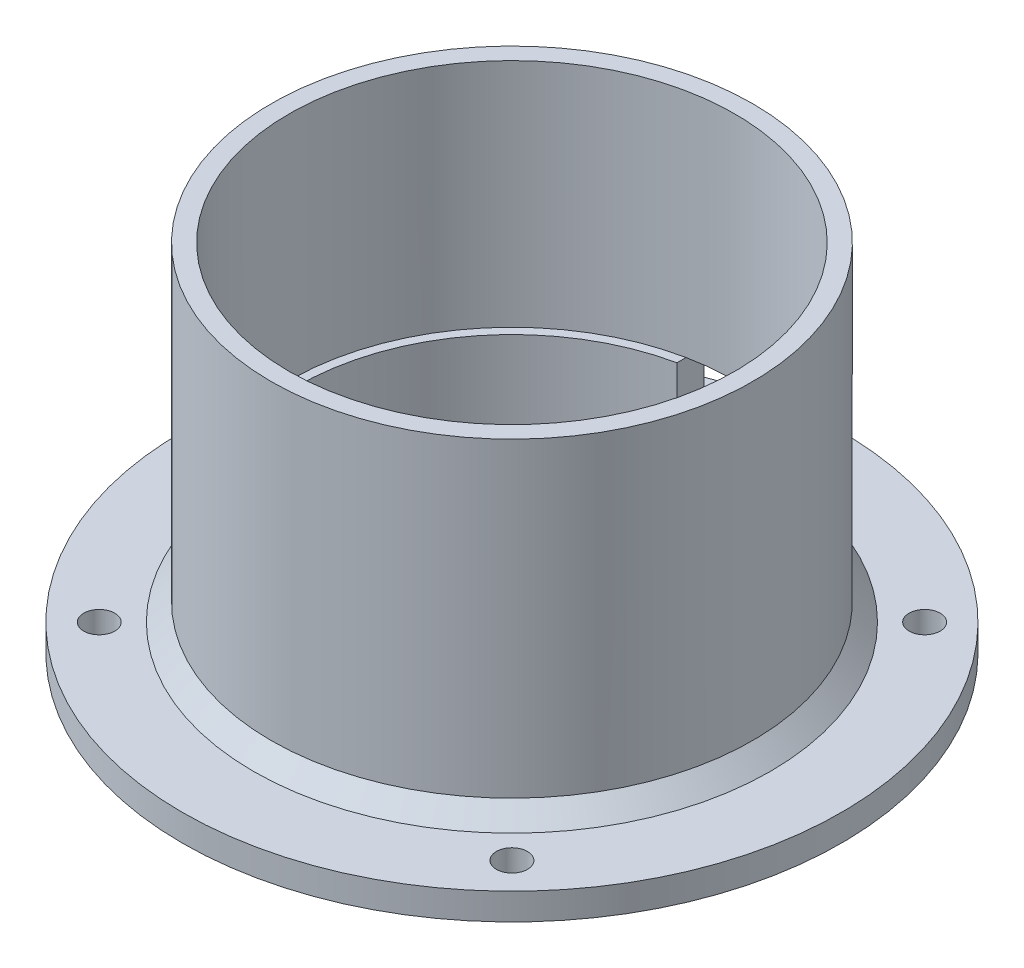
ISO-10303-21;
HEADER;
FILE_DESCRIPTION(('STEP AP214'),'2;1');
FILE_NAME('part.step','',(''),(''),'','','');
FILE_SCHEMA(('AUTOMOTIVE_DESIGN { 1 0 10303 214 1 1 1 1 }'));
ENDSEC;
DATA;
#1=APPLICATION_CONTEXT('core data for automotive mechanical design processes');
#2=APPLICATION_PROTOCOL_DEFINITION('international standard','automotive_design',2000,#1);
#3=PRODUCT_CONTEXT('',#1,'mechanical');
#4=PRODUCT('Part','Part','',(#3));
#5=PRODUCT_RELATED_PRODUCT_CATEGORY('part','',(#4));
#6=PRODUCT_DEFINITION_FORMATION('','',#4);
#7=PRODUCT_DEFINITION_CONTEXT('part definition',#1,'design');
#8=PRODUCT_DEFINITION('design','',#6,#7);
#9=PRODUCT_DEFINITION_SHAPE('','',#8);
#10=(LENGTH_UNIT() NAMED_UNIT(*) SI_UNIT(.MILLI.,.METRE.));
#11=(NAMED_UNIT(*) PLANE_ANGLE_UNIT() SI_UNIT($,.RADIAN.));
#12=(NAMED_UNIT(*) SI_UNIT($,.STERADIAN.) SOLID_ANGLE_UNIT());
#13=UNCERTAINTY_MEASURE_WITH_UNIT(LENGTH_MEASURE(1.E-05),#10,'distance_accuracy_value','');
#14=(GEOMETRIC_REPRESENTATION_CONTEXT(3) GLOBAL_UNCERTAINTY_ASSIGNED_CONTEXT((#13)) GLOBAL_UNIT_ASSIGNED_CONTEXT((#10,
#11,#12)) REPRESENTATION_CONTEXT('',''));
#15=CARTESIAN_POINT('',(0.,0.,0.));
#16=DIRECTION('',(0.,0.,1.));
#17=DIRECTION('',(1.,0.,0.));
#18=AXIS2_PLACEMENT_3D('',#15,#16,#17);
#19=CARTESIAN_POINT('',(0.,0.,0.));
#20=DIRECTION('',(0.,1.,0.));
#21=DIRECTION('',(0.,0.,1.));
#22=AXIS2_PLACEMENT_3D('',#19,#20,#21);
#23=CYLINDRICAL_SURFACE('',#22,25.1);
#24=CARTESIAN_POINT('',(0.,-13.,0.));
#25=DIRECTION('',(0.,1.,0.));
#26=DIRECTION('',(0.,0.,1.));
#27=AXIS2_PLACEMENT_3D('',#24,#25,#26);
#28=CIRCLE('',#27,25.1);
#29=CARTESIAN_POINT('',(5.,-13.,-24.5969510305647));
#30=VERTEX_POINT('',#29);
#31=CARTESIAN_POINT('',(-5.,-13.,-24.5969510305647));
#32=VERTEX_POINT('',#31);
#33=EDGE_CURVE('E162',#30,#32,#28,.T.);
#34=ORIENTED_EDGE('',*,*,#33,.F.);
#35=EDGE_CURVE('E165',#32,#30,#28,.T.);
#36=ORIENTED_EDGE('',*,*,#35,.F.);
#37=EDGE_LOOP('',(#34,#36));
#38=FACE_BOUND('',#37,.T.);
#39=CARTESIAN_POINT('',(0.,13.,0.));
#40=DIRECTION('',(0.,1.,0.));
#41=DIRECTION('',(0.,0.,1.));
#42=AXIS2_PLACEMENT_3D('',#39,#40,#41);
#43=CIRCLE('',#42,25.1);
#44=CARTESIAN_POINT('',(0.,13.,25.1));
#45=VERTEX_POINT('',#44);
#46=EDGE_CURVE('E184',#45,#45,#43,.T.);
#47=ORIENTED_EDGE('',*,*,#46,.T.);
#48=EDGE_LOOP('',(#47));
#49=FACE_BOUND('',#48,.T.);
#50=ADVANCED_FACE('F42',(#38,#49),#23,.F.);
#51=CARTESIAN_POINT('',(25.1,13.,0.));
#52=DIRECTION('',(0.,-1.,0.));
#53=DIRECTION('',(0.,0.,-1.));
#54=AXIS2_PLACEMENT_3D('',#51,#52,#53);
#55=PLANE('',#54);
#56=ORIENTED_EDGE('',*,*,#46,.F.);
#57=EDGE_LOOP('',(#56));
#58=FACE_BOUND('',#57,.T.);
#59=CARTESIAN_POINT('',(0.,13.,0.));
#60=DIRECTION('',(0.,1.,0.));
#61=DIRECTION('',(0.,0.,1.));
#62=AXIS2_PLACEMENT_3D('',#59,#60,#61);
#63=CIRCLE('',#62,27.1);
#64=CARTESIAN_POINT('',(0.,13.,27.1));
#65=VERTEX_POINT('',#64);
#66=EDGE_CURVE('E180',#65,#65,#63,.T.);
#67=ORIENTED_EDGE('',*,*,#66,.T.);
#68=EDGE_LOOP('',(#67));
#69=FACE_BOUND('',#68,.T.);
#70=ADVANCED_FACE('F270',(#58,#69),#55,.F.);
#71=CARTESIAN_POINT('',(0.,0.,0.));
#72=DIRECTION('',(0.,1.,0.));
#73=DIRECTION('',(0.,0.,1.));
#74=AXIS2_PLACEMENT_3D('',#71,#72,#73);
#75=CYLINDRICAL_SURFACE('',#74,27.1);
#76=DIRECTION('',(0.,1.,0.));
#77=VECTOR('',#76,1.);
#78=CARTESIAN_POINT('',(-4.99999999999997,0.,-26.63475173528));
#79=LINE('',#78,#77);
#80=CARTESIAN_POINT('',(-5.,-13.,-26.63475173528));
#81=VERTEX_POINT('',#80);
#82=CARTESIAN_POINT('',(-4.99999999999997,-22.,-26.63475173528));
#83=VERTEX_POINT('',#82);
#84=EDGE_CURVE('E137',#81,#83,#79,.F.);
#85=ORIENTED_EDGE('',*,*,#84,.T.);
#86=CARTESIAN_POINT('',(0.,-22.,0.));
#87=DIRECTION('',(0.,-1.,0.));
#88=DIRECTION('',(0.,0.,-1.));
#89=AXIS2_PLACEMENT_3D('',#86,#87,#88);
#90=CIRCLE('',#89,27.1);
#91=CARTESIAN_POINT('',(5.,-22.,-26.63475173528));
#92=VERTEX_POINT('',#91);
#93=EDGE_CURVE('E106',#83,#92,#90,.F.);
#94=ORIENTED_EDGE('',*,*,#93,.T.);
#95=DIRECTION('',(0.,1.,0.));
#96=VECTOR('',#95,1.);
#97=CARTESIAN_POINT('',(5.,0.,-26.63475173528));
#98=LINE('',#97,#96);
#99=CARTESIAN_POINT('',(5.,-13.,-26.63475173528));
#100=VERTEX_POINT('',#99);
#101=EDGE_CURVE('E124',#92,#100,#98,.T.);
#102=ORIENTED_EDGE('',*,*,#101,.T.);
#103=CARTESIAN_POINT('',(0.,-13.,0.));
#104=DIRECTION('',(0.,1.,0.));
#105=DIRECTION('',(-1.,0.,0.));
#106=AXIS2_PLACEMENT_3D('',#103,#104,#105);
#107=CIRCLE('',#106,27.1);
#108=EDGE_CURVE('E141',#100,#81,#107,.T.);
#109=ORIENTED_EDGE('',*,*,#108,.T.);
#110=EDGE_LOOP('',(#85,#94,#102,#109));
#111=FACE_BOUND('',#110,.T.);
#112=ORIENTED_EDGE('',*,*,#66,.F.);
#113=EDGE_LOOP('',(#112));
#114=FACE_BOUND('',#113,.T.);
#115=ADVANCED_FACE('F266',(#111,#114),#75,.T.);
#116=CARTESIAN_POINT('',(27.1,-24.,0.));
#117=DIRECTION('',(0.,-1.,0.));
#118=DIRECTION('',(0.,0.,-1.));
#119=AXIS2_PLACEMENT_3D('',#116,#117,#118);
#120=PLANE('',#119);
#121=CARTESIAN_POINT('',(0.,-24.,0.));
#122=DIRECTION('',(0.,-1.,0.));
#123=DIRECTION('',(0.,0.,-1.));
#124=AXIS2_PLACEMENT_3D('',#121,#122,#123);
#125=CIRCLE('',#124,29.1);
#126=CARTESIAN_POINT('',(0.,-24.,-29.1));
#127=VERTEX_POINT('',#126);
#128=EDGE_CURVE('E212',#127,#127,#125,.T.);
#129=ORIENTED_EDGE('',*,*,#128,.T.);
#130=EDGE_LOOP('',(#129));
#131=FACE_BOUND('',#130,.T.);
#132=CARTESIAN_POINT('',(-23.2284577619782,-24.,23.228457761978));
#133=DIRECTION('',(0.,1.,0.));
#134=DIRECTION('',(0.,0.,1.));
#135=AXIS2_PLACEMENT_3D('',#132,#133,#134);
#136=CIRCLE('',#135,1.75);
#137=CARTESIAN_POINT('',(-23.2284577619782,-24.,24.978457761978));
#138=VERTEX_POINT('',#137);
#139=EDGE_CURVE('E145',#138,#138,#136,.T.);
#140=ORIENTED_EDGE('',*,*,#139,.F.);
#141=EDGE_LOOP('',(#140));
#142=FACE_BOUND('',#141,.T.);
#143=CARTESIAN_POINT('',(23.228457761978,-24.,23.2284577619782));
#144=DIRECTION('',(0.,1.,0.));
#145=DIRECTION('',(0.,0.,1.));
#146=AXIS2_PLACEMENT_3D('',#143,#144,#145);
#147=CIRCLE('',#146,1.75);
#148=CARTESIAN_POINT('',(23.228457761978,-24.,24.9784577619782));
#149=VERTEX_POINT('',#148);
#150=EDGE_CURVE('E151',#149,#149,#147,.T.);
#151=ORIENTED_EDGE('',*,*,#150,.F.);
#152=EDGE_LOOP('',(#151));
#153=FACE_BOUND('',#152,.T.);
#154=CARTESIAN_POINT('',(23.2284577619782,-24.,-23.2284577619779));
#155=DIRECTION('',(0.,1.,0.));
#156=DIRECTION('',(0.,0.,1.));
#157=AXIS2_PLACEMENT_3D('',#154,#155,#156);
#158=CIRCLE('',#157,1.75);
#159=CARTESIAN_POINT('',(23.2284577619782,-24.,-21.4784577619779));
#160=VERTEX_POINT('',#159);
#161=EDGE_CURVE('E146',#160,#160,#158,.T.);
#162=ORIENTED_EDGE('',*,*,#161,.F.);
#163=EDGE_LOOP('',(#162));
#164=FACE_BOUND('',#163,.T.);
#165=CARTESIAN_POINT('',(-23.228457761978,-24.,-23.2284577619782));
#166=DIRECTION('',(0.,1.,0.));
#167=DIRECTION('',(0.,0.,1.));
#168=AXIS2_PLACEMENT_3D('',#165,#166,#167);
#169=CIRCLE('',#168,1.75);
#170=CARTESIAN_POINT('',(-23.228457761978,-24.,-21.4784577619782));
#171=VERTEX_POINT('',#170);
#172=EDGE_CURVE('E150',#171,#171,#169,.T.);
#173=ORIENTED_EDGE('',*,*,#172,.F.);
#174=EDGE_LOOP('',(#173));
#175=FACE_BOUND('',#174,.T.);
#176=CARTESIAN_POINT('',(0.,-24.,0.));
#177=DIRECTION('',(0.,1.,0.));
#178=DIRECTION('',(0.,0.,1.));
#179=AXIS2_PLACEMENT_3D('',#176,#177,#178);
#180=CIRCLE('',#179,37.1);
#181=CARTESIAN_POINT('',(0.,-24.,37.1));
#182=VERTEX_POINT('',#181);
#183=EDGE_CURVE('E176',#182,#182,#180,.T.);
#184=ORIENTED_EDGE('',*,*,#183,.T.);
#185=EDGE_LOOP('',(#184));
#186=FACE_BOUND('',#185,.T.);
#187=ADVANCED_FACE('F262',(#131,#142,#153,#164,#175,#186),#120,.F.);
#188=CARTESIAN_POINT('',(0.,0.,0.));
#189=DIRECTION('',(0.,1.,0.));
#190=DIRECTION('',(0.,0.,1.));
#191=AXIS2_PLACEMENT_3D('',#188,#189,#190);
#192=CYLINDRICAL_SURFACE('',#191,37.1);
#193=ORIENTED_EDGE('',*,*,#183,.F.);
#194=EDGE_LOOP('',(#193));
#195=FACE_BOUND('',#194,.T.);
#196=CARTESIAN_POINT('',(0.,-27.,0.));
#197=DIRECTION('',(0.,1.,0.));
#198=DIRECTION('',(0.,0.,1.));
#199=AXIS2_PLACEMENT_3D('',#196,#197,#198);
#200=CIRCLE('',#199,37.1);
#201=CARTESIAN_POINT('',(0.,-27.,37.1));
#202=VERTEX_POINT('',#201);
#203=EDGE_CURVE('E172',#202,#202,#200,.T.);
#204=ORIENTED_EDGE('',*,*,#203,.T.);
#205=EDGE_LOOP('',(#204));
#206=FACE_BOUND('',#205,.T.);
#207=ADVANCED_FACE('F258',(#195,#206),#192,.T.);
#208=CARTESIAN_POINT('',(37.1,-27.,0.));
#209=DIRECTION('',(0.,1.,0.));
#210=DIRECTION('',(0.,0.,1.));
#211=AXIS2_PLACEMENT_3D('',#208,#209,#210);
#212=PLANE('',#211);
#213=CARTESIAN_POINT('',(-23.2284577619782,-27.,23.228457761978));
#214=DIRECTION('',(0.,1.,0.));
#215=DIRECTION('',(0.,0.,1.));
#216=AXIS2_PLACEMENT_3D('',#213,#214,#215);
#217=CIRCLE('',#216,1.75);
#218=CARTESIAN_POINT('',(-23.2284577619782,-27.,24.978457761978));
#219=VERTEX_POINT('',#218);
#220=EDGE_CURVE('E200',#219,#219,#217,.T.);
#221=ORIENTED_EDGE('',*,*,#220,.T.);
#222=EDGE_LOOP('',(#221));
#223=FACE_BOUND('',#222,.T.);
#224=CARTESIAN_POINT('',(23.228457761978,-27.,23.2284577619782));
#225=DIRECTION('',(0.,1.,0.));
#226=DIRECTION('',(0.,0.,1.));
#227=AXIS2_PLACEMENT_3D('',#224,#225,#226);
#228=CIRCLE('',#227,1.75);
#229=CARTESIAN_POINT('',(23.228457761978,-27.,24.9784577619782));
#230=VERTEX_POINT('',#229);
#231=EDGE_CURVE('E196',#230,#230,#228,.T.);
#232=ORIENTED_EDGE('',*,*,#231,.T.);
#233=EDGE_LOOP('',(#232));
#234=FACE_BOUND('',#233,.T.);
#235=CARTESIAN_POINT('',(23.2284577619782,-27.,-23.2284577619779));
#236=DIRECTION('',(0.,1.,0.));
#237=DIRECTION('',(0.,0.,1.));
#238=AXIS2_PLACEMENT_3D('',#235,#236,#237);
#239=CIRCLE('',#238,1.75);
#240=CARTESIAN_POINT('',(23.2284577619782,-27.,-21.4784577619779));
#241=VERTEX_POINT('',#240);
#242=EDGE_CURVE('E192',#241,#241,#239,.T.);
#243=ORIENTED_EDGE('',*,*,#242,.T.);
#244=EDGE_LOOP('',(#243));
#245=FACE_BOUND('',#244,.T.);
#246=CARTESIAN_POINT('',(-23.228457761978,-27.,-23.2284577619782));
#247=DIRECTION('',(0.,1.,0.));
#248=DIRECTION('',(0.,0.,1.));
#249=AXIS2_PLACEMENT_3D('',#246,#247,#248);
#250=CIRCLE('',#249,1.75);
#251=CARTESIAN_POINT('',(-23.228457761978,-27.,-21.4784577619782));
#252=VERTEX_POINT('',#251);
#253=EDGE_CURVE('E161',#252,#252,#250,.T.);
#254=ORIENTED_EDGE('',*,*,#253,.T.);
#255=EDGE_LOOP('',(#254));
#256=FACE_BOUND('',#255,.T.);
#257=ORIENTED_EDGE('',*,*,#203,.F.);
#258=EDGE_LOOP('',(#257));
#259=FACE_BOUND('',#258,.T.);
#260=CARTESIAN_POINT('',(0.,-27.,0.));
#261=DIRECTION('',(0.,1.,0.));
#262=DIRECTION('',(0.,0.,1.));
#263=AXIS2_PLACEMENT_3D('',#260,#261,#262);
#264=CIRCLE('',#263,24.1);
#265=CARTESIAN_POINT('',(0.,-27.,24.1));
#266=VERTEX_POINT('',#265);
#267=EDGE_CURVE('E168',#266,#266,#264,.T.);
#268=ORIENTED_EDGE('',*,*,#267,.T.);
#269=EDGE_LOOP('',(#268));
#270=FACE_BOUND('',#269,.T.);
#271=ADVANCED_FACE('F254',(#223,#234,#245,#256,#259,#270),#212,.F.);
#272=CARTESIAN_POINT('',(0.,0.,0.));
#273=DIRECTION('',(0.,1.,0.));
#274=DIRECTION('',(0.,0.,1.));
#275=AXIS2_PLACEMENT_3D('',#272,#273,#274);
#276=CYLINDRICAL_SURFACE('',#275,24.1);
#277=ORIENTED_EDGE('',*,*,#267,.F.);
#278=EDGE_LOOP('',(#277));
#279=FACE_BOUND('',#278,.T.);
#280=CARTESIAN_POINT('',(0.,-23.,0.));
#281=DIRECTION('',(0.,-1.,0.));
#282=DIRECTION('',(0.,0.,-1.));
#283=AXIS2_PLACEMENT_3D('',#280,#281,#282);
#284=CIRCLE('',#283,24.1);
#285=CARTESIAN_POINT('',(5.,-23.,-23.575623003433));
#286=VERTEX_POINT('',#285);
#287=CARTESIAN_POINT('',(-5.00000000000002,-23.,-23.575623003433));
#288=VERTEX_POINT('',#287);
#289=EDGE_CURVE('E100',#286,#288,#284,.F.);
#290=ORIENTED_EDGE('',*,*,#289,.T.);
#291=DIRECTION('',(0.,1.,0.));
#292=VECTOR('',#291,1.);
#293=CARTESIAN_POINT('',(-4.99999999999997,0.,-23.575623003433));
#294=LINE('',#293,#292);
#295=CARTESIAN_POINT('',(-5.,-13.,-23.575623003433));
#296=VERTEX_POINT('',#295);
#297=EDGE_CURVE('E129',#288,#296,#294,.T.);
#298=ORIENTED_EDGE('',*,*,#297,.T.);
#299=CARTESIAN_POINT('',(0.,-13.,0.));
#300=DIRECTION('',(0.,1.,0.));
#301=DIRECTION('',(0.,0.,1.));
#302=AXIS2_PLACEMENT_3D('',#299,#300,#301);
#303=CIRCLE('',#302,24.1);
#304=CARTESIAN_POINT('',(5.,-13.,-23.575623003433));
#305=VERTEX_POINT('',#304);
#306=EDGE_CURVE('E122',#296,#305,#303,.T.);
#307=ORIENTED_EDGE('',*,*,#306,.T.);
#308=DIRECTION('',(0.,1.,0.));
#309=VECTOR('',#308,1.);
#310=CARTESIAN_POINT('',(5.,0.,-23.575623003433));
#311=LINE('',#310,#309);
#312=EDGE_CURVE('E111',#305,#286,#311,.F.);
#313=ORIENTED_EDGE('',*,*,#312,.T.);
#314=EDGE_LOOP('',(#290,#298,#307,#313));
#315=FACE_BOUND('',#314,.T.);
#316=ADVANCED_FACE('F120',(#279,#315),#276,.F.);
#317=CARTESIAN_POINT('',(24.1,-13.,0.));
#318=DIRECTION('',(0.,-1.,0.));
#319=DIRECTION('',(0.,0.,-1.));
#320=AXIS2_PLACEMENT_3D('',#317,#318,#319);
#321=PLANE('',#320);
#322=ORIENTED_EDGE('',*,*,#306,.F.);
#323=DIRECTION('',(0.,0.,-1.));
#324=VECTOR('',#323,1.);
#325=CARTESIAN_POINT('',(-5.,-13.,0.));
#326=LINE('',#325,#324);
#327=EDGE_CURVE('E107',#296,#32,#326,.T.);
#328=ORIENTED_EDGE('',*,*,#327,.T.);
#329=ORIENTED_EDGE('',*,*,#35,.T.);
#330=DIRECTION('',(0.,0.,1.));
#331=VECTOR('',#330,1.);
#332=CARTESIAN_POINT('',(5.,-13.,0.));
#333=LINE('',#332,#331);
#334=EDGE_CURVE('E188',#30,#305,#333,.T.);
#335=ORIENTED_EDGE('',*,*,#334,.T.);
#336=EDGE_LOOP('',(#322,#328,#329,#335));
#337=FACE_BOUND('',#336,.T.);
#338=ADVANCED_FACE('F247',(#337),#321,.F.);
#339=CARTESIAN_POINT('',(-23.228457761978,-34.,-23.2284577619782));
#340=DIRECTION('',(0.,1.,0.));
#341=DIRECTION('',(0.,0.,1.));
#342=AXIS2_PLACEMENT_3D('',#339,#340,#341);
#343=CYLINDRICAL_SURFACE('',#342,1.75);
#344=ORIENTED_EDGE('',*,*,#172,.T.);
#345=EDGE_LOOP('',(#344));
#346=FACE_BOUND('',#345,.T.);
#347=ORIENTED_EDGE('',*,*,#253,.F.);
#348=EDGE_LOOP('',(#347));
#349=FACE_BOUND('',#348,.T.);
#350=ADVANCED_FACE('F236',(#346,#349),#343,.F.);
#351=CARTESIAN_POINT('',(23.2284577619782,-34.,-23.2284577619779));
#352=DIRECTION('',(0.,1.,0.));
#353=DIRECTION('',(0.,0.,1.));
#354=AXIS2_PLACEMENT_3D('',#351,#352,#353);
#355=CYLINDRICAL_SURFACE('',#354,1.75);
#356=ORIENTED_EDGE('',*,*,#161,.T.);
#357=EDGE_LOOP('',(#356));
#358=FACE_BOUND('',#357,.T.);
#359=ORIENTED_EDGE('',*,*,#242,.F.);
#360=EDGE_LOOP('',(#359));
#361=FACE_BOUND('',#360,.T.);
#362=ADVANCED_FACE('F232',(#358,#361),#355,.F.);
#363=CARTESIAN_POINT('',(23.228457761978,-34.,23.2284577619782));
#364=DIRECTION('',(0.,1.,0.));
#365=DIRECTION('',(0.,0.,1.));
#366=AXIS2_PLACEMENT_3D('',#363,#364,#365);
#367=CYLINDRICAL_SURFACE('',#366,1.75);
#368=ORIENTED_EDGE('',*,*,#150,.T.);
#369=EDGE_LOOP('',(#368));
#370=FACE_BOUND('',#369,.T.);
#371=ORIENTED_EDGE('',*,*,#231,.F.);
#372=EDGE_LOOP('',(#371));
#373=FACE_BOUND('',#372,.T.);
#374=ADVANCED_FACE('F235',(#370,#373),#367,.F.);
#375=CARTESIAN_POINT('',(-23.2284577619782,-34.,23.228457761978));
#376=DIRECTION('',(0.,1.,0.));
#377=DIRECTION('',(0.,0.,1.));
#378=AXIS2_PLACEMENT_3D('',#375,#376,#377);
#379=CYLINDRICAL_SURFACE('',#378,1.75);
#380=ORIENTED_EDGE('',*,*,#139,.T.);
#381=EDGE_LOOP('',(#380));
#382=FACE_BOUND('',#381,.T.);
#383=ORIENTED_EDGE('',*,*,#220,.F.);
#384=EDGE_LOOP('',(#383));
#385=FACE_BOUND('',#384,.T.);
#386=ADVANCED_FACE('F240',(#382,#385),#379,.F.);
#387=CARTESIAN_POINT('',(-5.,-13.,-50.));
#388=DIRECTION('',(0.,1.,0.));
#389=DIRECTION('',(-1.,0.,0.));
#390=AXIS2_PLACEMENT_3D('',#387,#388,#389);
#391=PLANE('',#390);
#392=DIRECTION('',(0.,0.,1.));
#393=VECTOR('',#392,1.);
#394=CARTESIAN_POINT('',(-5.,-13.,-50.));
#395=LINE('',#394,#393);
#396=EDGE_CURVE('E125',#81,#32,#395,.T.);
#397=ORIENTED_EDGE('',*,*,#396,.F.);
#398=ORIENTED_EDGE('',*,*,#108,.F.);
#399=DIRECTION('',(0.,0.,1.));
#400=VECTOR('',#399,1.);
#401=CARTESIAN_POINT('',(5.,-13.,-50.));
#402=LINE('',#401,#400);
#403=EDGE_CURVE('E117',#100,#30,#402,.T.);
#404=ORIENTED_EDGE('',*,*,#403,.T.);
#405=ORIENTED_EDGE('',*,*,#33,.T.);
#406=EDGE_LOOP('',(#397,#398,#404,#405));
#407=FACE_BOUND('',#406,.T.);
#408=ADVANCED_FACE('F227',(#407),#391,.F.);
#409=CARTESIAN_POINT('',(-5.00000000000002,-23.,-50.));
#410=DIRECTION('',(0.,-1.,0.));
#411=DIRECTION('',(0.,0.,-1.));
#412=AXIS2_PLACEMENT_3D('',#409,#410,#411);
#413=PLANE('',#412);
#414=DIRECTION('',(0.,0.,1.));
#415=VECTOR('',#414,1.);
#416=CARTESIAN_POINT('',(-5.00000000000002,-23.,-50.));
#417=LINE('',#416,#415);
#418=CARTESIAN_POINT('',(-5.00000000000002,-23.,-27.6515822332105));
#419=VERTEX_POINT('',#418);
#420=EDGE_CURVE('E64',#419,#288,#417,.T.);
#421=ORIENTED_EDGE('',*,*,#420,.T.);
#422=ORIENTED_EDGE('',*,*,#289,.F.);
#423=DIRECTION('',(0.,0.,1.));
#424=VECTOR('',#423,1.);
#425=CARTESIAN_POINT('',(5.,-23.,-50.));
#426=LINE('',#425,#424);
#427=CARTESIAN_POINT('',(5.,-23.,-27.6515822332105));
#428=VERTEX_POINT('',#427);
#429=EDGE_CURVE('E71',#428,#286,#426,.T.);
#430=ORIENTED_EDGE('',*,*,#429,.F.);
#431=CARTESIAN_POINT('',(0.,-23.,0.));
#432=DIRECTION('',(0.,-1.,0.));
#433=DIRECTION('',(0.,0.,-1.));
#434=AXIS2_PLACEMENT_3D('',#431,#432,#433);
#435=CIRCLE('',#434,28.1);
#436=EDGE_CURVE('E58',#428,#419,#435,.F.);
#437=ORIENTED_EDGE('',*,*,#436,.T.);
#438=EDGE_LOOP('',(#421,#422,#430,#437));
#439=FACE_BOUND('',#438,.T.);
#440=ADVANCED_FACE('F101',(#439),#413,.F.);
#441=CARTESIAN_POINT('',(-5.00000000000002,-23.,-50.));
#442=DIRECTION('',(-1.,0.,0.));
#443=DIRECTION('',(0.,-1.,0.));
#444=AXIS2_PLACEMENT_3D('',#441,#442,#443);
#445=PLANE('',#444);
#446=ORIENTED_EDGE('',*,*,#396,.T.);
#447=ORIENTED_EDGE('',*,*,#327,.F.);
#448=ORIENTED_EDGE('',*,*,#297,.F.);
#449=ORIENTED_EDGE('',*,*,#420,.F.);
#450=CARTESIAN_POINT('',(-5.00000000000002,-23.,-27.6515822332105));
#451=CARTESIAN_POINT('',(-5.00000000000002,-22.8332812338349,-27.4821617208497));
#452=CARTESIAN_POINT('',(-5.00000000000002,-22.6665885174547,-27.312715589878));
#453=CARTESIAN_POINT('',(-5.00000000000002,-22.3332551841214,-26.9737720905679));
#454=CARTESIAN_POINT('',(-5.00000000000002,-22.1666145671682,-26.8042747222294));
#455=CARTESIAN_POINT('',(-5.00000000000002,-22.,-26.63475173528));
#456=B_SPLINE_CURVE_WITH_KNOTS('',3,(#450,#451,#452,#453,#454,#455),.UNSPECIFIED.,.F.,.F.,(4,2,
4),(0.,0.713082096928014,1.42616419446647),.UNSPECIFIED.);
#457=EDGE_CURVE('E11',#419,#83,#456,.T.);
#458=ORIENTED_EDGE('',*,*,#457,.T.);
#459=ORIENTED_EDGE('',*,*,#84,.F.);
#460=EDGE_LOOP('',(#446,#447,#448,#449,#458,#459));
#461=FACE_BOUND('',#460,.T.);
#462=ADVANCED_FACE('F226',(#461),#445,.F.);
#463=CARTESIAN_POINT('',(5.,-23.,-50.));
#464=DIRECTION('',(1.,0.,0.));
#465=DIRECTION('',(0.,1.,0.));
#466=AXIS2_PLACEMENT_3D('',#463,#464,#465);
#467=PLANE('',#466);
#468=ORIENTED_EDGE('',*,*,#429,.T.);
#469=ORIENTED_EDGE('',*,*,#312,.F.);
#470=ORIENTED_EDGE('',*,*,#334,.F.);
#471=ORIENTED_EDGE('',*,*,#403,.F.);
#472=ORIENTED_EDGE('',*,*,#101,.F.);
#473=CARTESIAN_POINT('',(5.,-22.,-26.63475173528));
#474=CARTESIAN_POINT('',(5.,-22.1666145671682,-26.8042747222294));
#475=CARTESIAN_POINT('',(5.,-22.3332551841214,-26.9737720905679));
#476=CARTESIAN_POINT('',(5.,-22.6665885174547,-27.312715589878));
#477=CARTESIAN_POINT('',(5.,-22.8332812338349,-27.4821617208497));
#478=CARTESIAN_POINT('',(5.,-23.,-27.6515822332105));
#479=B_SPLINE_CURVE_WITH_KNOTS('',3,(#473,#474,#475,#476,#477,#478),.UNSPECIFIED.,.F.,.F.,(4,2,
4),(0.,0.713082097538457,1.42616419446647),.UNSPECIFIED.);
#480=EDGE_CURVE('E114',#92,#428,#479,.T.);
#481=ORIENTED_EDGE('',*,*,#480,.T.);
#482=EDGE_LOOP('',(#468,#469,#470,#471,#472,#481));
#483=FACE_BOUND('',#482,.T.);
#484=ADVANCED_FACE('F110',(#483),#467,.F.);
#485=CARTESIAN_POINT('',(0.,-22.,0.));
#486=DIRECTION('',(0.,-1.,0.));
#487=DIRECTION('',(0.,0.,-1.));
#488=AXIS2_PLACEMENT_3D('',#485,#486,#487);
#489=CONICAL_SURFACE('',#488,27.1,0.785398163397443);
#490=ORIENTED_EDGE('',*,*,#128,.F.);
#491=EDGE_LOOP('',(#490));
#492=FACE_BOUND('',#491,.T.);
#493=ORIENTED_EDGE('',*,*,#480,.F.);
#494=ORIENTED_EDGE('',*,*,#93,.F.);
#495=ORIENTED_EDGE('',*,*,#457,.F.);
#496=ORIENTED_EDGE('',*,*,#436,.F.);
#497=EDGE_LOOP('',(#493,#494,#495,#496));
#498=FACE_BOUND('',#497,.T.);
#499=ADVANCED_FACE('F45',(#492,#498),#489,.T.);
#500=CLOSED_SHELL('',(#50,#70,#115,#187,#207,#271,#316,#338,#350,#362,#374,#386,#408,#440,#462,
#484,#499));
#501=MANIFOLD_SOLID_BREP('B2',#500);
#502=ADVANCED_BREP_SHAPE_REPRESENTATION('',(#18,#501),#14);
#503=SHAPE_DEFINITION_REPRESENTATION(#9,#502);
ENDSEC;
END-ISO-10303-21;
